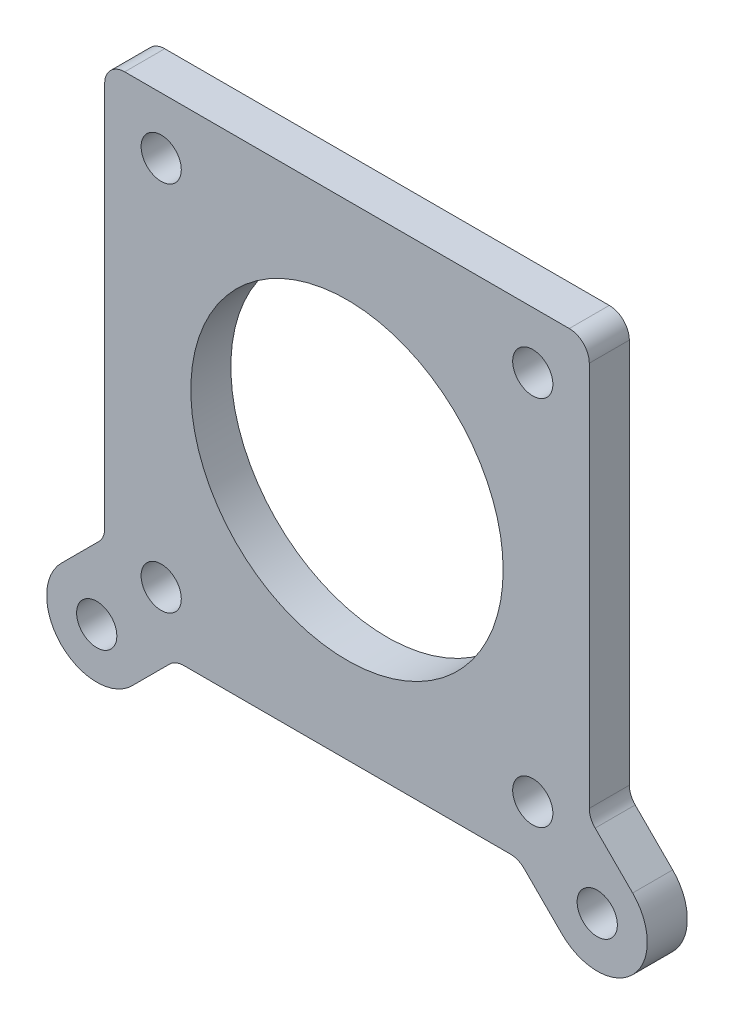
ISO-10303-21;
HEADER;
FILE_DESCRIPTION(('STEP AP214'),'2;1');
FILE_NAME('part.step','',(''),(''),'','','');
FILE_SCHEMA(('AUTOMOTIVE_DESIGN { 1 0 10303 214 1 1 1 1 }'));
ENDSEC;
DATA;
#1=APPLICATION_CONTEXT('core data for automotive mechanical design processes');
#2=APPLICATION_PROTOCOL_DEFINITION('international standard','automotive_design',2000,#1);
#3=PRODUCT_CONTEXT('',#1,'mechanical');
#4=PRODUCT('Part','Part','',(#3));
#5=PRODUCT_RELATED_PRODUCT_CATEGORY('part','',(#4));
#6=PRODUCT_DEFINITION_FORMATION('','',#4);
#7=PRODUCT_DEFINITION_CONTEXT('part definition',#1,'design');
#8=PRODUCT_DEFINITION('design','',#6,#7);
#9=PRODUCT_DEFINITION_SHAPE('','',#8);
#10=(LENGTH_UNIT() NAMED_UNIT(*) SI_UNIT(.MILLI.,.METRE.));
#11=(NAMED_UNIT(*) PLANE_ANGLE_UNIT() SI_UNIT($,.RADIAN.));
#12=(NAMED_UNIT(*) SI_UNIT($,.STERADIAN.) SOLID_ANGLE_UNIT());
#13=UNCERTAINTY_MEASURE_WITH_UNIT(LENGTH_MEASURE(1.E-05),#10,'distance_accuracy_value','');
#14=(GEOMETRIC_REPRESENTATION_CONTEXT(3) GLOBAL_UNCERTAINTY_ASSIGNED_CONTEXT((#13)) GLOBAL_UNIT_ASSIGNED_CONTEXT((#10,
#11,#12)) REPRESENTATION_CONTEXT('',''));
#15=CARTESIAN_POINT('',(0.,0.,0.));
#16=DIRECTION('',(0.,0.,1.));
#17=DIRECTION('',(1.,0.,0.));
#18=AXIS2_PLACEMENT_3D('',#15,#16,#17);
#19=CARTESIAN_POINT('',(-30.74,30.74,-5.08));
#20=DIRECTION('',(-1.,0.,0.));
#21=DIRECTION('',(0.,-1.,0.));
#22=AXIS2_PLACEMENT_3D('',#19,#20,#21);
#23=PLANE('',#22);
#24=DIRECTION('',(0.,-1.,0.));
#25=VECTOR('',#24,1.);
#26=CARTESIAN_POINT('',(-30.74,30.74,-5.08));
#27=LINE('',#26,#25);
#28=CARTESIAN_POINT('',(-30.74,28.2,-5.08));
#29=VERTEX_POINT('',#28);
#30=CARTESIAN_POINT('',(-30.74,-20.7076414305032,-5.08));
#31=VERTEX_POINT('',#30);
#32=EDGE_CURVE('E238',#29,#31,#27,.T.);
#33=ORIENTED_EDGE('',*,*,#32,.T.);
#34=DIRECTION('',(0.,0.,1.));
#35=VECTOR('',#34,1.);
#36=CARTESIAN_POINT('',(-30.74,-20.7076414305032,0.));
#37=LINE('',#36,#35);
#38=CARTESIAN_POINT('',(-30.74,-20.7076414305032,0.));
#39=VERTEX_POINT('',#38);
#40=EDGE_CURVE('E291',#31,#39,#37,.T.);
#41=ORIENTED_EDGE('',*,*,#40,.T.);
#42=DIRECTION('',(0.,-1.,0.));
#43=VECTOR('',#42,1.);
#44=CARTESIAN_POINT('',(-30.74,30.74,0.));
#45=LINE('',#44,#43);
#46=CARTESIAN_POINT('',(-30.74,28.2,0.));
#47=VERTEX_POINT('',#46);
#48=EDGE_CURVE('E235',#47,#39,#45,.T.);
#49=ORIENTED_EDGE('',*,*,#48,.F.);
#50=DIRECTION('',(0.,0.,1.));
#51=VECTOR('',#50,1.);
#52=CARTESIAN_POINT('',(-30.74,28.2,-5.08));
#53=LINE('',#52,#51);
#54=EDGE_CURVE('E270',#47,#29,#53,.F.);
#55=ORIENTED_EDGE('',*,*,#54,.T.);
#56=EDGE_LOOP('',(#33,#41,#49,#55));
#57=FACE_BOUND('',#56,.T.);
#58=ADVANCED_FACE('F35',(#57),#23,.T.);
#59=CARTESIAN_POINT('',(-30.74,30.74,-5.08));
#60=DIRECTION('',(0.,1.,0.));
#61=DIRECTION('',(0.,0.,1.));
#62=AXIS2_PLACEMENT_3D('',#59,#60,#61);
#63=PLANE('',#62);
#64=DIRECTION('',(-1.,0.,0.));
#65=VECTOR('',#64,1.);
#66=CARTESIAN_POINT('',(-30.74,30.74,-5.08));
#67=LINE('',#66,#65);
#68=CARTESIAN_POINT('',(28.2,30.74,-5.08));
#69=VERTEX_POINT('',#68);
#70=CARTESIAN_POINT('',(-28.2,30.74,-5.08));
#71=VERTEX_POINT('',#70);
#72=EDGE_CURVE('E247',#69,#71,#67,.T.);
#73=ORIENTED_EDGE('',*,*,#72,.T.);
#74=DIRECTION('',(0.,0.,1.));
#75=VECTOR('',#74,1.);
#76=CARTESIAN_POINT('',(-28.2,30.74,-5.08));
#77=LINE('',#76,#75);
#78=CARTESIAN_POINT('',(-28.2,30.74,0.));
#79=VERTEX_POINT('',#78);
#80=EDGE_CURVE('E274',#71,#79,#77,.T.);
#81=ORIENTED_EDGE('',*,*,#80,.T.);
#82=DIRECTION('',(-1.,0.,0.));
#83=VECTOR('',#82,1.);
#84=CARTESIAN_POINT('',(-30.74,30.74,0.));
#85=LINE('',#84,#83);
#86=CARTESIAN_POINT('',(28.2,30.74,0.));
#87=VERTEX_POINT('',#86);
#88=EDGE_CURVE('E242',#87,#79,#85,.T.);
#89=ORIENTED_EDGE('',*,*,#88,.F.);
#90=DIRECTION('',(0.,0.,1.));
#91=VECTOR('',#90,1.);
#92=CARTESIAN_POINT('',(28.2,30.74,-5.08));
#93=LINE('',#92,#91);
#94=EDGE_CURVE('E272',#87,#69,#93,.F.);
#95=ORIENTED_EDGE('',*,*,#94,.T.);
#96=EDGE_LOOP('',(#73,#81,#89,#95));
#97=FACE_BOUND('',#96,.T.);
#98=ADVANCED_FACE('F347',(#97),#63,.T.);
#99=CARTESIAN_POINT('',(30.74,30.74,-5.08));
#100=DIRECTION('',(1.,0.,0.));
#101=DIRECTION('',(0.,1.,0.));
#102=AXIS2_PLACEMENT_3D('',#99,#100,#101);
#103=PLANE('',#102);
#104=DIRECTION('',(0.,1.,0.));
#105=VECTOR('',#104,1.);
#106=CARTESIAN_POINT('',(30.74,30.74,0.));
#107=LINE('',#106,#105);
#108=CARTESIAN_POINT('',(30.74,-20.7076414305032,0.));
#109=VERTEX_POINT('',#108);
#110=CARTESIAN_POINT('',(30.74,28.2,0.));
#111=VERTEX_POINT('',#110);
#112=EDGE_CURVE('E255',#109,#111,#107,.T.);
#113=ORIENTED_EDGE('',*,*,#112,.F.);
#114=DIRECTION('',(0.,0.,1.));
#115=VECTOR('',#114,1.);
#116=CARTESIAN_POINT('',(30.74,-20.7076414305032,-5.08));
#117=LINE('',#116,#115);
#118=CARTESIAN_POINT('',(30.74,-20.7076414305032,-5.08));
#119=VERTEX_POINT('',#118);
#120=EDGE_CURVE('E279',#109,#119,#117,.F.);
#121=ORIENTED_EDGE('',*,*,#120,.T.);
#122=DIRECTION('',(0.,1.,0.));
#123=VECTOR('',#122,1.);
#124=CARTESIAN_POINT('',(30.74,30.74,-5.08));
#125=LINE('',#124,#123);
#126=CARTESIAN_POINT('',(30.74,28.2,-5.08));
#127=VERTEX_POINT('',#126);
#128=EDGE_CURVE('E245',#119,#127,#125,.T.);
#129=ORIENTED_EDGE('',*,*,#128,.T.);
#130=DIRECTION('',(0.,0.,1.));
#131=VECTOR('',#130,1.);
#132=CARTESIAN_POINT('',(30.74,28.2,-5.08));
#133=LINE('',#132,#131);
#134=EDGE_CURVE('E262',#127,#111,#133,.T.);
#135=ORIENTED_EDGE('',*,*,#134,.T.);
#136=EDGE_LOOP('',(#113,#121,#129,#135));
#137=FACE_BOUND('',#136,.T.);
#138=ADVANCED_FACE('F334',(#137),#103,.T.);
#139=CARTESIAN_POINT('',(-30.74,-30.74,-5.08));
#140=DIRECTION('',(0.,-1.,0.));
#141=DIRECTION('',(0.,0.,-1.));
#142=AXIS2_PLACEMENT_3D('',#139,#140,#141);
#143=PLANE('',#142);
#144=DIRECTION('',(1.,0.,0.));
#145=VECTOR('',#144,1.);
#146=CARTESIAN_POINT('',(-30.74,-30.74,-5.08));
#147=LINE('',#146,#145);
#148=CARTESIAN_POINT('',(-20.7076414305032,-30.74,-5.08));
#149=VERTEX_POINT('',#148);
#150=CARTESIAN_POINT('',(20.7076414305032,-30.74,-5.08));
#151=VERTEX_POINT('',#150);
#152=EDGE_CURVE('E241',#149,#151,#147,.T.);
#153=ORIENTED_EDGE('',*,*,#152,.T.);
#154=DIRECTION('',(0.,0.,1.));
#155=VECTOR('',#154,1.);
#156=CARTESIAN_POINT('',(20.7076414305032,-30.74,0.));
#157=LINE('',#156,#155);
#158=CARTESIAN_POINT('',(20.7076414305032,-30.74,0.));
#159=VERTEX_POINT('',#158);
#160=EDGE_CURVE('E283',#151,#159,#157,.T.);
#161=ORIENTED_EDGE('',*,*,#160,.T.);
#162=DIRECTION('',(1.,0.,0.));
#163=VECTOR('',#162,1.);
#164=CARTESIAN_POINT('',(-30.74,-30.74,0.));
#165=LINE('',#164,#163);
#166=CARTESIAN_POINT('',(-20.7076414305032,-30.74,0.));
#167=VERTEX_POINT('',#166);
#168=EDGE_CURVE('E252',#167,#159,#165,.T.);
#169=ORIENTED_EDGE('',*,*,#168,.F.);
#170=DIRECTION('',(0.,0.,1.));
#171=VECTOR('',#170,1.);
#172=CARTESIAN_POINT('',(-20.7076414305032,-30.74,-5.08));
#173=LINE('',#172,#171);
#174=EDGE_CURVE('E281',#167,#149,#173,.F.);
#175=ORIENTED_EDGE('',*,*,#174,.T.);
#176=EDGE_LOOP('',(#153,#161,#169,#175));
#177=FACE_BOUND('',#176,.T.);
#178=ADVANCED_FACE('F320',(#177),#143,.T.);
#179=CARTESIAN_POINT('',(0.,0.,-5.08));
#180=DIRECTION('',(0.,0.,1.));
#181=DIRECTION('',(1.,0.,0.));
#182=AXIS2_PLACEMENT_3D('',#179,#180,#181);
#183=PLANE('',#182);
#184=CARTESIAN_POINT('',(-31.75,-31.75,-5.08));
#185=DIRECTION('',(0.,0.,1.));
#186=DIRECTION('',(1.,0.,0.));
#187=AXIS2_PLACEMENT_3D('',#184,#185,#186);
#188=CIRCLE('',#187,2.5527);
#189=CARTESIAN_POINT('',(-29.1973,-31.75,-5.08));
#190=VERTEX_POINT('',#189);
#191=EDGE_CURVE('E581',#190,#190,#188,.T.);
#192=ORIENTED_EDGE('',*,*,#191,.T.);
#193=EDGE_LOOP('',(#192));
#194=FACE_BOUND('',#193,.T.);
#195=CARTESIAN_POINT('',(31.75,-31.75,-5.08));
#196=DIRECTION('',(0.,0.,1.));
#197=DIRECTION('',(1.,0.,0.));
#198=AXIS2_PLACEMENT_3D('',#195,#196,#197);
#199=CIRCLE('',#198,2.5527);
#200=CARTESIAN_POINT('',(34.3027,-31.75,-5.08));
#201=VERTEX_POINT('',#200);
#202=EDGE_CURVE('E178',#201,#201,#199,.T.);
#203=ORIENTED_EDGE('',*,*,#202,.T.);
#204=EDGE_LOOP('',(#203));
#205=FACE_BOUND('',#204,.T.);
#206=ORIENTED_EDGE('',*,*,#128,.F.);
#207=CARTESIAN_POINT('',(33.28,-20.7076414305032,-5.08));
#208=DIRECTION('',(0.,0.,1.));
#209=DIRECTION('',(1.,0.,0.));
#210=AXIS2_PLACEMENT_3D('',#207,#208,#209);
#211=CIRCLE('',#210,2.54);
#212=CARTESIAN_POINT('',(31.4839487757862,-22.503692654717,-5.08));
#213=VERTEX_POINT('',#212);
#214=EDGE_CURVE('E169',#119,#213,#211,.T.);
#215=ORIENTED_EDGE('',*,*,#214,.T.);
#216=DIRECTION('',(-0.707106781186546,0.707106781186549,0.));
#217=VECTOR('',#216,1.);
#218=CARTESIAN_POINT('',(36.2401280605346,-27.2598719394654,-5.08));
#219=LINE('',#218,#217);
#220=CARTESIAN_POINT('',(36.2401280605346,-27.2598719394654,-5.08));
#221=VERTEX_POINT('',#220);
#222=EDGE_CURVE('E150',#221,#213,#219,.T.);
#223=ORIENTED_EDGE('',*,*,#222,.F.);
#224=CARTESIAN_POINT('',(31.75,-31.75,-5.08));
#225=DIRECTION('',(0.,0.,1.));
#226=DIRECTION('',(-1.,0.,0.));
#227=AXIS2_PLACEMENT_3D('',#224,#225,#226);
#228=CIRCLE('',#227,6.35000000000001);
#229=CARTESIAN_POINT('',(27.2598719394654,-36.2401280605346,-5.08));
#230=VERTEX_POINT('',#229);
#231=EDGE_CURVE('E167',#230,#221,#228,.T.);
#232=ORIENTED_EDGE('',*,*,#231,.F.);
#233=DIRECTION('',(0.707106781186547,-0.707106781186548,0.));
#234=VECTOR('',#233,1.);
#235=CARTESIAN_POINT('',(27.2598719394654,-36.2401280605346,-5.08));
#236=LINE('',#235,#234);
#237=CARTESIAN_POINT('',(22.503692654717,-31.4839487757862,-5.08));
#238=VERTEX_POINT('',#237);
#239=EDGE_CURVE('E159',#238,#230,#236,.T.);
#240=ORIENTED_EDGE('',*,*,#239,.F.);
#241=CARTESIAN_POINT('',(20.7076414305032,-33.28,-5.08));
#242=DIRECTION('',(0.,0.,1.));
#243=DIRECTION('',(1.,0.,0.));
#244=AXIS2_PLACEMENT_3D('',#241,#242,#243);
#245=CIRCLE('',#244,2.54);
#246=EDGE_CURVE('E300',#238,#151,#245,.T.);
#247=ORIENTED_EDGE('',*,*,#246,.T.);
#248=ORIENTED_EDGE('',*,*,#152,.F.);
#249=CARTESIAN_POINT('',(-20.7076414305032,-33.28,-5.08));
#250=DIRECTION('',(0.,0.,1.));
#251=DIRECTION('',(1.,0.,0.));
#252=AXIS2_PLACEMENT_3D('',#249,#250,#251);
#253=CIRCLE('',#252,2.54);
#254=CARTESIAN_POINT('',(-22.503692654717,-31.4839487757862,-5.08));
#255=VERTEX_POINT('',#254);
#256=EDGE_CURVE('E304',#149,#255,#253,.T.);
#257=ORIENTED_EDGE('',*,*,#256,.T.);
#258=DIRECTION('',(0.707106781186547,0.707106781186548,0.));
#259=VECTOR('',#258,1.);
#260=CARTESIAN_POINT('',(-27.2598719394654,-36.2401280605346,-5.08));
#261=LINE('',#260,#259);
#262=CARTESIAN_POINT('',(-27.2598719394654,-36.2401280605346,-5.08));
#263=VERTEX_POINT('',#262);
#264=EDGE_CURVE('E190',#263,#255,#261,.T.);
#265=ORIENTED_EDGE('',*,*,#264,.F.);
#266=CARTESIAN_POINT('',(-31.75,-31.75,-5.08));
#267=DIRECTION('',(0.,0.,1.));
#268=DIRECTION('',(1.,0.,0.));
#269=AXIS2_PLACEMENT_3D('',#266,#267,#268);
#270=CIRCLE('',#269,6.35);
#271=CARTESIAN_POINT('',(-36.2401280605346,-27.2598719394654,-5.08));
#272=VERTEX_POINT('',#271);
#273=EDGE_CURVE('E187',#272,#263,#270,.T.);
#274=ORIENTED_EDGE('',*,*,#273,.F.);
#275=DIRECTION('',(-0.707106781186547,-0.707106781186548,0.));
#276=VECTOR('',#275,1.);
#277=CARTESIAN_POINT('',(-36.2401280605346,-27.2598719394654,-5.08));
#278=LINE('',#277,#276);
#279=CARTESIAN_POINT('',(-31.4839487757862,-22.503692654717,-5.08));
#280=VERTEX_POINT('',#279);
#281=EDGE_CURVE('E194',#280,#272,#278,.T.);
#282=ORIENTED_EDGE('',*,*,#281,.F.);
#283=CARTESIAN_POINT('',(-33.28,-20.7076414305032,-5.08));
#284=DIRECTION('',(0.,0.,1.));
#285=DIRECTION('',(1.,0.,0.));
#286=AXIS2_PLACEMENT_3D('',#283,#284,#285);
#287=CIRCLE('',#286,2.54);
#288=EDGE_CURVE('E11',#280,#31,#287,.T.);
#289=ORIENTED_EDGE('',*,*,#288,.T.);
#290=ORIENTED_EDGE('',*,*,#32,.F.);
#291=CARTESIAN_POINT('',(-28.2,28.2,-5.08));
#292=DIRECTION('',(0.,0.,1.));
#293=DIRECTION('',(1.,0.,0.));
#294=AXIS2_PLACEMENT_3D('',#291,#292,#293);
#295=CIRCLE('',#294,2.54);
#296=EDGE_CURVE('E268',#29,#71,#295,.F.);
#297=ORIENTED_EDGE('',*,*,#296,.T.);
#298=ORIENTED_EDGE('',*,*,#72,.F.);
#299=CARTESIAN_POINT('',(28.2,28.2,-5.08));
#300=DIRECTION('',(0.,0.,1.));
#301=DIRECTION('',(1.,0.,0.));
#302=AXIS2_PLACEMENT_3D('',#299,#300,#301);
#303=CIRCLE('',#302,2.54);
#304=EDGE_CURVE('E265',#69,#127,#303,.F.);
#305=ORIENTED_EDGE('',*,*,#304,.T.);
#306=EDGE_LOOP('',(#206,#215,#223,#232,#240,#247,#248,#257,#265,#274,#282,#289,#290,#297,#298,#305));
#307=FACE_BOUND('',#306,.T.);
#308=CARTESIAN_POINT('',(-1.48387746534695E-07,1.48793546927983E-07,-5.08));
#309=DIRECTION('',(0.,0.,1.));
#310=DIRECTION('',(1.,0.,0.));
#311=AXIS2_PLACEMENT_3D('',#308,#309,#310);
#312=CIRCLE('',#311,19.812);
#313=CARTESIAN_POINT('',(19.8119998516123,1.48793546927983E-07,-5.08));
#314=VERTEX_POINT('',#313);
#315=EDGE_CURVE('E208',#314,#314,#312,.T.);
#316=ORIENTED_EDGE('',*,*,#315,.T.);
#317=EDGE_LOOP('',(#316));
#318=FACE_BOUND('',#317,.T.);
#319=CARTESIAN_POINT('',(-23.5700001483877,-23.5699998512065,-5.08));
#320=DIRECTION('',(0.,0.,1.));
#321=DIRECTION('',(1.,0.,0.));
#322=AXIS2_PLACEMENT_3D('',#319,#320,#321);
#323=CIRCLE('',#322,2.55);
#324=CARTESIAN_POINT('',(-21.0200001483877,-23.5699998512065,-5.08));
#325=VERTEX_POINT('',#324);
#326=EDGE_CURVE('E214',#325,#325,#323,.T.);
#327=ORIENTED_EDGE('',*,*,#326,.T.);
#328=EDGE_LOOP('',(#327));
#329=FACE_BOUND('',#328,.T.);
#330=CARTESIAN_POINT('',(23.5699998516123,-23.5699998512065,-5.08));
#331=DIRECTION('',(0.,0.,1.));
#332=DIRECTION('',(1.,0.,0.));
#333=AXIS2_PLACEMENT_3D('',#330,#331,#332);
#334=CIRCLE('',#333,2.55);
#335=CARTESIAN_POINT('',(26.1199998516123,-23.5699998512065,-5.08));
#336=VERTEX_POINT('',#335);
#337=EDGE_CURVE('E220',#336,#336,#334,.T.);
#338=ORIENTED_EDGE('',*,*,#337,.T.);
#339=EDGE_LOOP('',(#338));
#340=FACE_BOUND('',#339,.T.);
#341=CARTESIAN_POINT('',(23.5699998516123,23.5700001487935,-5.08));
#342=DIRECTION('',(0.,0.,1.));
#343=DIRECTION('',(1.,0.,0.));
#344=AXIS2_PLACEMENT_3D('',#341,#342,#343);
#345=CIRCLE('',#344,2.55);
#346=CARTESIAN_POINT('',(26.1199998516123,23.5700001487935,-5.08));
#347=VERTEX_POINT('',#346);
#348=EDGE_CURVE('E226',#347,#347,#345,.T.);
#349=ORIENTED_EDGE('',*,*,#348,.T.);
#350=EDGE_LOOP('',(#349));
#351=FACE_BOUND('',#350,.T.);
#352=CARTESIAN_POINT('',(-23.5700001483877,23.5700001487935,-5.08));
#353=DIRECTION('',(0.,0.,1.));
#354=DIRECTION('',(1.,0.,0.));
#355=AXIS2_PLACEMENT_3D('',#352,#353,#354);
#356=CIRCLE('',#355,2.55);
#357=CARTESIAN_POINT('',(-21.0200001483877,23.5700001487935,-5.08));
#358=VERTEX_POINT('',#357);
#359=EDGE_CURVE('E232',#358,#358,#356,.T.);
#360=ORIENTED_EDGE('',*,*,#359,.T.);
#361=EDGE_LOOP('',(#360));
#362=FACE_BOUND('',#361,.T.);
#363=ADVANCED_FACE('F164',(#194,#205,#307,#318,#329,#340,#351,#362),#183,.F.);
#364=CARTESIAN_POINT('',(0.,0.,0.));
#365=DIRECTION('',(0.,0.,1.));
#366=DIRECTION('',(1.,0.,0.));
#367=AXIS2_PLACEMENT_3D('',#364,#365,#366);
#368=PLANE('',#367);
#369=CARTESIAN_POINT('',(-31.75,-31.75,0.));
#370=DIRECTION('',(0.,0.,1.));
#371=DIRECTION('',(1.,0.,0.));
#372=AXIS2_PLACEMENT_3D('',#369,#370,#371);
#373=CIRCLE('',#372,2.5527);
#374=CARTESIAN_POINT('',(-29.1973,-31.75,0.));
#375=VERTEX_POINT('',#374);
#376=EDGE_CURVE('E584',#375,#375,#373,.T.);
#377=ORIENTED_EDGE('',*,*,#376,.F.);
#378=EDGE_LOOP('',(#377));
#379=FACE_BOUND('',#378,.T.);
#380=CARTESIAN_POINT('',(31.75,-31.75,0.));
#381=DIRECTION('',(0.,0.,1.));
#382=DIRECTION('',(1.,0.,0.));
#383=AXIS2_PLACEMENT_3D('',#380,#381,#382);
#384=CIRCLE('',#383,2.5527);
#385=CARTESIAN_POINT('',(34.3027,-31.75,0.));
#386=VERTEX_POINT('',#385);
#387=EDGE_CURVE('E586',#386,#386,#384,.T.);
#388=ORIENTED_EDGE('',*,*,#387,.F.);
#389=EDGE_LOOP('',(#388));
#390=FACE_BOUND('',#389,.T.);
#391=DIRECTION('',(-0.707106781186546,0.707106781186549,0.));
#392=VECTOR('',#391,1.);
#393=CARTESIAN_POINT('',(36.2401280605346,-27.2598719394654,0.));
#394=LINE('',#393,#392);
#395=CARTESIAN_POINT('',(36.2401280605346,-27.2598719394654,0.));
#396=VERTEX_POINT('',#395);
#397=CARTESIAN_POINT('',(31.4839487757862,-22.503692654717,0.));
#398=VERTEX_POINT('',#397);
#399=EDGE_CURVE('E153',#396,#398,#394,.T.);
#400=ORIENTED_EDGE('',*,*,#399,.T.);
#401=CARTESIAN_POINT('',(33.28,-20.7076414305032,0.));
#402=DIRECTION('',(0.,0.,1.));
#403=DIRECTION('',(1.,0.,0.));
#404=AXIS2_PLACEMENT_3D('',#401,#402,#403);
#405=CIRCLE('',#404,2.54);
#406=EDGE_CURVE('E295',#398,#109,#405,.F.);
#407=ORIENTED_EDGE('',*,*,#406,.T.);
#408=ORIENTED_EDGE('',*,*,#112,.T.);
#409=CARTESIAN_POINT('',(28.2,28.2,0.));
#410=DIRECTION('',(0.,0.,1.));
#411=DIRECTION('',(1.,0.,0.));
#412=AXIS2_PLACEMENT_3D('',#409,#410,#411);
#413=CIRCLE('',#412,2.54);
#414=EDGE_CURVE('E250',#111,#87,#413,.T.);
#415=ORIENTED_EDGE('',*,*,#414,.T.);
#416=ORIENTED_EDGE('',*,*,#88,.T.);
#417=CARTESIAN_POINT('',(-28.2,28.2,0.));
#418=DIRECTION('',(0.,0.,1.));
#419=DIRECTION('',(1.,0.,0.));
#420=AXIS2_PLACEMENT_3D('',#417,#418,#419);
#421=CIRCLE('',#420,2.54);
#422=EDGE_CURVE('E260',#79,#47,#421,.T.);
#423=ORIENTED_EDGE('',*,*,#422,.T.);
#424=ORIENTED_EDGE('',*,*,#48,.T.);
#425=CARTESIAN_POINT('',(-33.28,-20.7076414305032,0.));
#426=DIRECTION('',(0.,0.,1.));
#427=DIRECTION('',(1.,0.,0.));
#428=AXIS2_PLACEMENT_3D('',#425,#426,#427);
#429=CIRCLE('',#428,2.54);
#430=CARTESIAN_POINT('',(-31.4839487757862,-22.503692654717,0.));
#431=VERTEX_POINT('',#430);
#432=EDGE_CURVE('E43',#39,#431,#429,.F.);
#433=ORIENTED_EDGE('',*,*,#432,.T.);
#434=DIRECTION('',(-0.707106781186547,-0.707106781186548,0.));
#435=VECTOR('',#434,1.);
#436=CARTESIAN_POINT('',(-36.2401280605346,-27.2598719394654,0.));
#437=LINE('',#436,#435);
#438=CARTESIAN_POINT('',(-36.2401280605346,-27.2598719394654,0.));
#439=VERTEX_POINT('',#438);
#440=EDGE_CURVE('E191',#431,#439,#437,.T.);
#441=ORIENTED_EDGE('',*,*,#440,.T.);
#442=CARTESIAN_POINT('',(-31.75,-31.75,0.));
#443=DIRECTION('',(0.,0.,1.));
#444=DIRECTION('',(1.,0.,0.));
#445=AXIS2_PLACEMENT_3D('',#442,#443,#444);
#446=CIRCLE('',#445,6.35);
#447=CARTESIAN_POINT('',(-27.2598719394654,-36.2401280605346,0.));
#448=VERTEX_POINT('',#447);
#449=EDGE_CURVE('E185',#439,#448,#446,.T.);
#450=ORIENTED_EDGE('',*,*,#449,.T.);
#451=DIRECTION('',(0.707106781186547,0.707106781186548,0.));
#452=VECTOR('',#451,1.);
#453=CARTESIAN_POINT('',(-27.2598719394654,-36.2401280605346,0.));
#454=LINE('',#453,#452);
#455=CARTESIAN_POINT('',(-22.503692654717,-31.4839487757862,0.));
#456=VERTEX_POINT('',#455);
#457=EDGE_CURVE('E199',#448,#456,#454,.T.);
#458=ORIENTED_EDGE('',*,*,#457,.T.);
#459=CARTESIAN_POINT('',(-20.7076414305032,-33.28,0.));
#460=DIRECTION('',(0.,0.,1.));
#461=DIRECTION('',(1.,0.,0.));
#462=AXIS2_PLACEMENT_3D('',#459,#460,#461);
#463=CIRCLE('',#462,2.54);
#464=EDGE_CURVE('E302',#456,#167,#463,.F.);
#465=ORIENTED_EDGE('',*,*,#464,.T.);
#466=ORIENTED_EDGE('',*,*,#168,.T.);
#467=CARTESIAN_POINT('',(20.7076414305032,-33.28,0.));
#468=DIRECTION('',(0.,0.,1.));
#469=DIRECTION('',(1.,0.,0.));
#470=AXIS2_PLACEMENT_3D('',#467,#468,#469);
#471=CIRCLE('',#470,2.54);
#472=CARTESIAN_POINT('',(22.503692654717,-31.4839487757862,0.));
#473=VERTEX_POINT('',#472);
#474=EDGE_CURVE('E298',#159,#473,#471,.F.);
#475=ORIENTED_EDGE('',*,*,#474,.T.);
#476=DIRECTION('',(0.707106781186547,-0.707106781186548,0.));
#477=VECTOR('',#476,1.);
#478=CARTESIAN_POINT('',(27.2598719394654,-36.2401280605346,0.));
#479=LINE('',#478,#477);
#480=CARTESIAN_POINT('',(27.2598719394654,-36.2401280605346,0.));
#481=VERTEX_POINT('',#480);
#482=EDGE_CURVE('E174',#473,#481,#479,.T.);
#483=ORIENTED_EDGE('',*,*,#482,.T.);
#484=CARTESIAN_POINT('',(31.75,-31.75,0.));
#485=DIRECTION('',(0.,0.,1.));
#486=DIRECTION('',(-1.,0.,0.));
#487=AXIS2_PLACEMENT_3D('',#484,#485,#486);
#488=CIRCLE('',#487,6.35000000000001);
#489=EDGE_CURVE('E182',#481,#396,#488,.T.);
#490=ORIENTED_EDGE('',*,*,#489,.T.);
#491=EDGE_LOOP('',(#400,#407,#408,#415,#416,#423,#424,#433,#441,#450,#458,#465,#466,#475,#483,#490));
#492=FACE_BOUND('',#491,.T.);
#493=CARTESIAN_POINT('',(-1.48387746534695E-07,1.48793546927983E-07,0.));
#494=DIRECTION('',(0.,0.,1.));
#495=DIRECTION('',(1.,0.,0.));
#496=AXIS2_PLACEMENT_3D('',#493,#494,#495);
#497=CIRCLE('',#496,19.812);
#498=CARTESIAN_POINT('',(19.8119998516123,1.48793546927983E-07,0.));
#499=VERTEX_POINT('',#498);
#500=EDGE_CURVE('E206',#499,#499,#497,.T.);
#501=ORIENTED_EDGE('',*,*,#500,.F.);
#502=EDGE_LOOP('',(#501));
#503=FACE_BOUND('',#502,.T.);
#504=CARTESIAN_POINT('',(-23.5700001483877,-23.5699998512065,0.));
#505=DIRECTION('',(0.,0.,1.));
#506=DIRECTION('',(1.,0.,0.));
#507=AXIS2_PLACEMENT_3D('',#504,#505,#506);
#508=CIRCLE('',#507,2.55);
#509=CARTESIAN_POINT('',(-21.0200001483877,-23.5699998512065,0.));
#510=VERTEX_POINT('',#509);
#511=EDGE_CURVE('E211',#510,#510,#508,.T.);
#512=ORIENTED_EDGE('',*,*,#511,.F.);
#513=EDGE_LOOP('',(#512));
#514=FACE_BOUND('',#513,.T.);
#515=CARTESIAN_POINT('',(23.5699998516123,-23.5699998512065,0.));
#516=DIRECTION('',(0.,0.,1.));
#517=DIRECTION('',(1.,0.,0.));
#518=AXIS2_PLACEMENT_3D('',#515,#516,#517);
#519=CIRCLE('',#518,2.55);
#520=CARTESIAN_POINT('',(26.1199998516123,-23.5699998512065,0.));
#521=VERTEX_POINT('',#520);
#522=EDGE_CURVE('E217',#521,#521,#519,.T.);
#523=ORIENTED_EDGE('',*,*,#522,.F.);
#524=EDGE_LOOP('',(#523));
#525=FACE_BOUND('',#524,.T.);
#526=CARTESIAN_POINT('',(23.5699998516123,23.5700001487935,0.));
#527=DIRECTION('',(0.,0.,1.));
#528=DIRECTION('',(1.,0.,0.));
#529=AXIS2_PLACEMENT_3D('',#526,#527,#528);
#530=CIRCLE('',#529,2.55);
#531=CARTESIAN_POINT('',(26.1199998516123,23.5700001487935,0.));
#532=VERTEX_POINT('',#531);
#533=EDGE_CURVE('E223',#532,#532,#530,.T.);
#534=ORIENTED_EDGE('',*,*,#533,.F.);
#535=EDGE_LOOP('',(#534));
#536=FACE_BOUND('',#535,.T.);
#537=CARTESIAN_POINT('',(-23.5700001483877,23.5700001487935,0.));
#538=DIRECTION('',(0.,0.,1.));
#539=DIRECTION('',(1.,0.,0.));
#540=AXIS2_PLACEMENT_3D('',#537,#538,#539);
#541=CIRCLE('',#540,2.55);
#542=CARTESIAN_POINT('',(-21.0200001483877,23.5700001487935,0.));
#543=VERTEX_POINT('',#542);
#544=EDGE_CURVE('E229',#543,#543,#541,.T.);
#545=ORIENTED_EDGE('',*,*,#544,.F.);
#546=EDGE_LOOP('',(#545));
#547=FACE_BOUND('',#546,.T.);
#548=ADVANCED_FACE('F317',(#379,#390,#492,#503,#514,#525,#536,#547),#368,.T.);
#549=CARTESIAN_POINT('',(-23.5700001483877,23.5700001487935,-5.08));
#550=DIRECTION('',(0.,0.,1.));
#551=DIRECTION('',(1.,0.,0.));
#552=AXIS2_PLACEMENT_3D('',#549,#550,#551);
#553=CYLINDRICAL_SURFACE('',#552,2.55);
#554=ORIENTED_EDGE('',*,*,#359,.F.);
#555=EDGE_LOOP('',(#554));
#556=FACE_BOUND('',#555,.T.);
#557=ORIENTED_EDGE('',*,*,#544,.T.);
#558=EDGE_LOOP('',(#557));
#559=FACE_BOUND('',#558,.T.);
#560=ADVANCED_FACE('F408',(#556,#559),#553,.F.);
#561=CARTESIAN_POINT('',(23.5699998516123,23.5700001487935,-5.08));
#562=DIRECTION('',(0.,0.,1.));
#563=DIRECTION('',(1.,0.,0.));
#564=AXIS2_PLACEMENT_3D('',#561,#562,#563);
#565=CYLINDRICAL_SURFACE('',#564,2.55);
#566=ORIENTED_EDGE('',*,*,#348,.F.);
#567=EDGE_LOOP('',(#566));
#568=FACE_BOUND('',#567,.T.);
#569=ORIENTED_EDGE('',*,*,#533,.T.);
#570=EDGE_LOOP('',(#569));
#571=FACE_BOUND('',#570,.T.);
#572=ADVANCED_FACE('F404',(#568,#571),#565,.F.);
#573=CARTESIAN_POINT('',(23.5699998516123,-23.5699998512065,-5.08));
#574=DIRECTION('',(0.,0.,1.));
#575=DIRECTION('',(1.,0.,0.));
#576=AXIS2_PLACEMENT_3D('',#573,#574,#575);
#577=CYLINDRICAL_SURFACE('',#576,2.55);
#578=ORIENTED_EDGE('',*,*,#337,.F.);
#579=EDGE_LOOP('',(#578));
#580=FACE_BOUND('',#579,.T.);
#581=ORIENTED_EDGE('',*,*,#522,.T.);
#582=EDGE_LOOP('',(#581));
#583=FACE_BOUND('',#582,.T.);
#584=ADVANCED_FACE('F400',(#580,#583),#577,.F.);
#585=CARTESIAN_POINT('',(-23.5700001483877,-23.5699998512065,-5.08));
#586=DIRECTION('',(0.,0.,1.));
#587=DIRECTION('',(1.,0.,0.));
#588=AXIS2_PLACEMENT_3D('',#585,#586,#587);
#589=CYLINDRICAL_SURFACE('',#588,2.55);
#590=ORIENTED_EDGE('',*,*,#326,.F.);
#591=EDGE_LOOP('',(#590));
#592=FACE_BOUND('',#591,.T.);
#593=ORIENTED_EDGE('',*,*,#511,.T.);
#594=EDGE_LOOP('',(#593));
#595=FACE_BOUND('',#594,.T.);
#596=ADVANCED_FACE('F396',(#592,#595),#589,.F.);
#597=CARTESIAN_POINT('',(-1.48387746534695E-07,1.48793546927983E-07,-5.08));
#598=DIRECTION('',(0.,0.,1.));
#599=DIRECTION('',(1.,0.,0.));
#600=AXIS2_PLACEMENT_3D('',#597,#598,#599);
#601=CYLINDRICAL_SURFACE('',#600,19.812);
#602=ORIENTED_EDGE('',*,*,#315,.F.);
#603=EDGE_LOOP('',(#602));
#604=FACE_BOUND('',#603,.T.);
#605=ORIENTED_EDGE('',*,*,#500,.T.);
#606=EDGE_LOOP('',(#605));
#607=FACE_BOUND('',#606,.T.);
#608=ADVANCED_FACE('F361',(#604,#607),#601,.F.);
#609=CARTESIAN_POINT('',(-28.2,28.2,-5.08));
#610=DIRECTION('',(0.,0.,1.));
#611=DIRECTION('',(1.,0.,0.));
#612=AXIS2_PLACEMENT_3D('',#609,#610,#611);
#613=CYLINDRICAL_SURFACE('',#612,2.54);
#614=ORIENTED_EDGE('',*,*,#296,.F.);
#615=ORIENTED_EDGE('',*,*,#54,.F.);
#616=ORIENTED_EDGE('',*,*,#422,.F.);
#617=ORIENTED_EDGE('',*,*,#80,.F.);
#618=EDGE_LOOP('',(#614,#615,#616,#617));
#619=FACE_BOUND('',#618,.T.);
#620=ADVANCED_FACE('F358',(#619),#613,.T.);
#621=CARTESIAN_POINT('',(28.2,28.2,-5.08));
#622=DIRECTION('',(0.,0.,1.));
#623=DIRECTION('',(1.,0.,0.));
#624=AXIS2_PLACEMENT_3D('',#621,#622,#623);
#625=CYLINDRICAL_SURFACE('',#624,2.54);
#626=ORIENTED_EDGE('',*,*,#304,.F.);
#627=ORIENTED_EDGE('',*,*,#94,.F.);
#628=ORIENTED_EDGE('',*,*,#414,.F.);
#629=ORIENTED_EDGE('',*,*,#134,.F.);
#630=EDGE_LOOP('',(#626,#627,#628,#629));
#631=FACE_BOUND('',#630,.T.);
#632=ADVANCED_FACE('F360',(#631),#625,.T.);
#633=CARTESIAN_POINT('',(-31.75,-31.75,-5.08));
#634=DIRECTION('',(0.,0.,1.));
#635=DIRECTION('',(1.,0.,0.));
#636=AXIS2_PLACEMENT_3D('',#633,#634,#635);
#637=CYLINDRICAL_SURFACE('',#636,6.35);
#638=ORIENTED_EDGE('',*,*,#449,.F.);
#639=DIRECTION('',(0.,0.,1.));
#640=VECTOR('',#639,1.);
#641=CARTESIAN_POINT('',(-36.2401280605346,-27.2598719394654,-5.08));
#642=LINE('',#641,#640);
#643=EDGE_CURVE('E203',#272,#439,#642,.T.);
#644=ORIENTED_EDGE('',*,*,#643,.F.);
#645=ORIENTED_EDGE('',*,*,#273,.T.);
#646=DIRECTION('',(0.,0.,1.));
#647=VECTOR('',#646,1.);
#648=CARTESIAN_POINT('',(-27.2598719394654,-36.2401280605346,-5.08));
#649=LINE('',#648,#647);
#650=EDGE_CURVE('E196',#263,#448,#649,.T.);
#651=ORIENTED_EDGE('',*,*,#650,.T.);
#652=EDGE_LOOP('',(#638,#644,#645,#651));
#653=FACE_BOUND('',#652,.T.);
#654=ADVANCED_FACE('F364',(#653),#637,.T.);
#655=CARTESIAN_POINT('',(-36.2401280605346,-27.2598719394654,-5.08));
#656=DIRECTION('',(-0.707106781186548,0.707106781186547,0.));
#657=DIRECTION('',(-0.707106781186547,-0.707106781186548,0.));
#658=AXIS2_PLACEMENT_3D('',#655,#656,#657);
#659=PLANE('',#658);
#660=ORIENTED_EDGE('',*,*,#440,.F.);
#661=DIRECTION('',(0.,0.,1.));
#662=VECTOR('',#661,1.);
#663=CARTESIAN_POINT('',(-31.4839487757862,-22.503692654717,-5.08));
#664=LINE('',#663,#662);
#665=EDGE_CURVE('E50',#431,#280,#664,.F.);
#666=ORIENTED_EDGE('',*,*,#665,.T.);
#667=ORIENTED_EDGE('',*,*,#281,.T.);
#668=ORIENTED_EDGE('',*,*,#643,.T.);
#669=EDGE_LOOP('',(#660,#666,#667,#668));
#670=FACE_BOUND('',#669,.T.);
#671=ADVANCED_FACE('F369',(#670),#659,.T.);
#672=CARTESIAN_POINT('',(-27.2598719394654,-36.2401280605346,-5.08));
#673=DIRECTION('',(0.707106781186548,-0.707106781186547,0.));
#674=DIRECTION('',(0.707106781186547,0.707106781186548,0.));
#675=AXIS2_PLACEMENT_3D('',#672,#673,#674);
#676=PLANE('',#675);
#677=ORIENTED_EDGE('',*,*,#264,.T.);
#678=DIRECTION('',(0.,0.,1.));
#679=VECTOR('',#678,1.);
#680=CARTESIAN_POINT('',(-22.503692654717,-31.4839487757862,0.));
#681=LINE('',#680,#679);
#682=EDGE_CURVE('E288',#255,#456,#681,.T.);
#683=ORIENTED_EDGE('',*,*,#682,.T.);
#684=ORIENTED_EDGE('',*,*,#457,.F.);
#685=ORIENTED_EDGE('',*,*,#650,.F.);
#686=EDGE_LOOP('',(#677,#683,#684,#685));
#687=FACE_BOUND('',#686,.T.);
#688=ADVANCED_FACE('F313',(#687),#676,.T.);
#689=CARTESIAN_POINT('',(31.75,-31.75,-5.08));
#690=DIRECTION('',(0.,0.,1.));
#691=DIRECTION('',(1.,0.,0.));
#692=AXIS2_PLACEMENT_3D('',#689,#690,#691);
#693=CYLINDRICAL_SURFACE('',#692,6.35000000000001);
#694=ORIENTED_EDGE('',*,*,#489,.F.);
#695=DIRECTION('',(0.,0.,1.));
#696=VECTOR('',#695,1.);
#697=CARTESIAN_POINT('',(27.2598719394654,-36.2401280605346,-5.08));
#698=LINE('',#697,#696);
#699=EDGE_CURVE('E158',#230,#481,#698,.T.);
#700=ORIENTED_EDGE('',*,*,#699,.F.);
#701=ORIENTED_EDGE('',*,*,#231,.T.);
#702=DIRECTION('',(0.,0.,1.));
#703=VECTOR('',#702,1.);
#704=CARTESIAN_POINT('',(36.2401280605346,-27.2598719394654,-5.08));
#705=LINE('',#704,#703);
#706=EDGE_CURVE('E146',#221,#396,#705,.T.);
#707=ORIENTED_EDGE('',*,*,#706,.T.);
#708=EDGE_LOOP('',(#694,#700,#701,#707));
#709=FACE_BOUND('',#708,.T.);
#710=ADVANCED_FACE('F172',(#709),#693,.T.);
#711=CARTESIAN_POINT('',(27.2598719394654,-36.2401280605346,-5.08));
#712=DIRECTION('',(-0.707106781186548,-0.707106781186547,0.));
#713=DIRECTION('',(0.707106781186547,-0.707106781186548,0.));
#714=AXIS2_PLACEMENT_3D('',#711,#712,#713);
#715=PLANE('',#714);
#716=ORIENTED_EDGE('',*,*,#482,.F.);
#717=DIRECTION('',(0.,0.,1.));
#718=VECTOR('',#717,1.);
#719=CARTESIAN_POINT('',(22.503692654717,-31.4839487757862,-5.08));
#720=LINE('',#719,#718);
#721=EDGE_CURVE('E286',#473,#238,#720,.F.);
#722=ORIENTED_EDGE('',*,*,#721,.T.);
#723=ORIENTED_EDGE('',*,*,#239,.T.);
#724=ORIENTED_EDGE('',*,*,#699,.T.);
#725=EDGE_LOOP('',(#716,#722,#723,#724));
#726=FACE_BOUND('',#725,.T.);
#727=ADVANCED_FACE('F328',(#726),#715,.T.);
#728=CARTESIAN_POINT('',(36.2401280605346,-27.2598719394654,-5.08));
#729=DIRECTION('',(0.707106781186549,0.707106781186546,0.));
#730=DIRECTION('',(-0.707106781186546,0.707106781186549,0.));
#731=AXIS2_PLACEMENT_3D('',#728,#729,#730);
#732=PLANE('',#731);
#733=ORIENTED_EDGE('',*,*,#222,.T.);
#734=DIRECTION('',(0.,0.,1.));
#735=VECTOR('',#734,1.);
#736=CARTESIAN_POINT('',(31.4839487757862,-22.503692654717,0.));
#737=LINE('',#736,#735);
#738=EDGE_CURVE('E277',#213,#398,#737,.T.);
#739=ORIENTED_EDGE('',*,*,#738,.T.);
#740=ORIENTED_EDGE('',*,*,#399,.F.);
#741=ORIENTED_EDGE('',*,*,#706,.F.);
#742=EDGE_LOOP('',(#733,#739,#740,#741));
#743=FACE_BOUND('',#742,.T.);
#744=ADVANCED_FACE('F148',(#743),#732,.T.);
#745=CARTESIAN_POINT('',(33.28,-20.7076414305032,-5.08));
#746=DIRECTION('',(0.,0.,-1.));
#747=DIRECTION('',(-1.,0.,0.));
#748=AXIS2_PLACEMENT_3D('',#745,#746,#747);
#749=CYLINDRICAL_SURFACE('',#748,2.54);
#750=ORIENTED_EDGE('',*,*,#214,.F.);
#751=ORIENTED_EDGE('',*,*,#120,.F.);
#752=ORIENTED_EDGE('',*,*,#406,.F.);
#753=ORIENTED_EDGE('',*,*,#738,.F.);
#754=EDGE_LOOP('',(#750,#751,#752,#753));
#755=FACE_BOUND('',#754,.T.);
#756=ADVANCED_FACE('F336',(#755),#749,.F.);
#757=CARTESIAN_POINT('',(20.7076414305032,-33.28,-5.08));
#758=DIRECTION('',(0.,0.,-1.));
#759=DIRECTION('',(-1.,0.,0.));
#760=AXIS2_PLACEMENT_3D('',#757,#758,#759);
#761=CYLINDRICAL_SURFACE('',#760,2.54);
#762=ORIENTED_EDGE('',*,*,#246,.F.);
#763=ORIENTED_EDGE('',*,*,#721,.F.);
#764=ORIENTED_EDGE('',*,*,#474,.F.);
#765=ORIENTED_EDGE('',*,*,#160,.F.);
#766=EDGE_LOOP('',(#762,#763,#764,#765));
#767=FACE_BOUND('',#766,.T.);
#768=ADVANCED_FACE('F324',(#767),#761,.F.);
#769=CARTESIAN_POINT('',(-20.7076414305032,-33.28,-5.08));
#770=DIRECTION('',(0.,0.,-1.));
#771=DIRECTION('',(-1.,0.,0.));
#772=AXIS2_PLACEMENT_3D('',#769,#770,#771);
#773=CYLINDRICAL_SURFACE('',#772,2.54);
#774=ORIENTED_EDGE('',*,*,#256,.F.);
#775=ORIENTED_EDGE('',*,*,#174,.F.);
#776=ORIENTED_EDGE('',*,*,#464,.F.);
#777=ORIENTED_EDGE('',*,*,#682,.F.);
#778=EDGE_LOOP('',(#774,#775,#776,#777));
#779=FACE_BOUND('',#778,.T.);
#780=ADVANCED_FACE('F315',(#779),#773,.F.);
#781=CARTESIAN_POINT('',(-33.28,-20.7076414305032,-5.08));
#782=DIRECTION('',(0.,0.,-1.));
#783=DIRECTION('',(-1.,0.,0.));
#784=AXIS2_PLACEMENT_3D('',#781,#782,#783);
#785=CYLINDRICAL_SURFACE('',#784,2.54);
#786=ORIENTED_EDGE('',*,*,#288,.F.);
#787=ORIENTED_EDGE('',*,*,#665,.F.);
#788=ORIENTED_EDGE('',*,*,#432,.F.);
#789=ORIENTED_EDGE('',*,*,#40,.F.);
#790=EDGE_LOOP('',(#786,#787,#788,#789));
#791=FACE_BOUND('',#790,.T.);
#792=ADVANCED_FACE('F37',(#791),#785,.F.);
#793=CARTESIAN_POINT('',(31.75,-31.75,0.));
#794=DIRECTION('',(0.,0.,1.));
#795=DIRECTION('',(1.,0.,0.));
#796=AXIS2_PLACEMENT_3D('',#793,#794,#795);
#797=CYLINDRICAL_SURFACE('',#796,2.5527);
#798=ORIENTED_EDGE('',*,*,#202,.F.);
#799=EDGE_LOOP('',(#798));
#800=FACE_BOUND('',#799,.T.);
#801=ORIENTED_EDGE('',*,*,#387,.T.);
#802=EDGE_LOOP('',(#801));
#803=FACE_BOUND('',#802,.T.);
#804=ADVANCED_FACE('F556',(#800,#803),#797,.F.);
#805=CARTESIAN_POINT('',(-31.75,-31.75,0.));
#806=DIRECTION('',(0.,0.,1.));
#807=DIRECTION('',(1.,0.,0.));
#808=AXIS2_PLACEMENT_3D('',#805,#806,#807);
#809=CYLINDRICAL_SURFACE('',#808,2.5527);
#810=ORIENTED_EDGE('',*,*,#191,.F.);
#811=EDGE_LOOP('',(#810));
#812=FACE_BOUND('',#811,.T.);
#813=ORIENTED_EDGE('',*,*,#376,.T.);
#814=EDGE_LOOP('',(#813));
#815=FACE_BOUND('',#814,.T.);
#816=ADVANCED_FACE('F564',(#812,#815),#809,.F.);
#817=CLOSED_SHELL('',(#58,#98,#138,#178,#363,#548,#560,#572,#584,#596,#608,#620,#632,#654,#671,
#688,#710,#727,#744,#756,#768,#780,#792,#804,#816));
#818=MANIFOLD_SOLID_BREP('B2',#817);
#819=ADVANCED_BREP_SHAPE_REPRESENTATION('',(#18,#818),#14);
#820=SHAPE_DEFINITION_REPRESENTATION(#9,#819);
ENDSEC;
END-ISO-10303-21;
